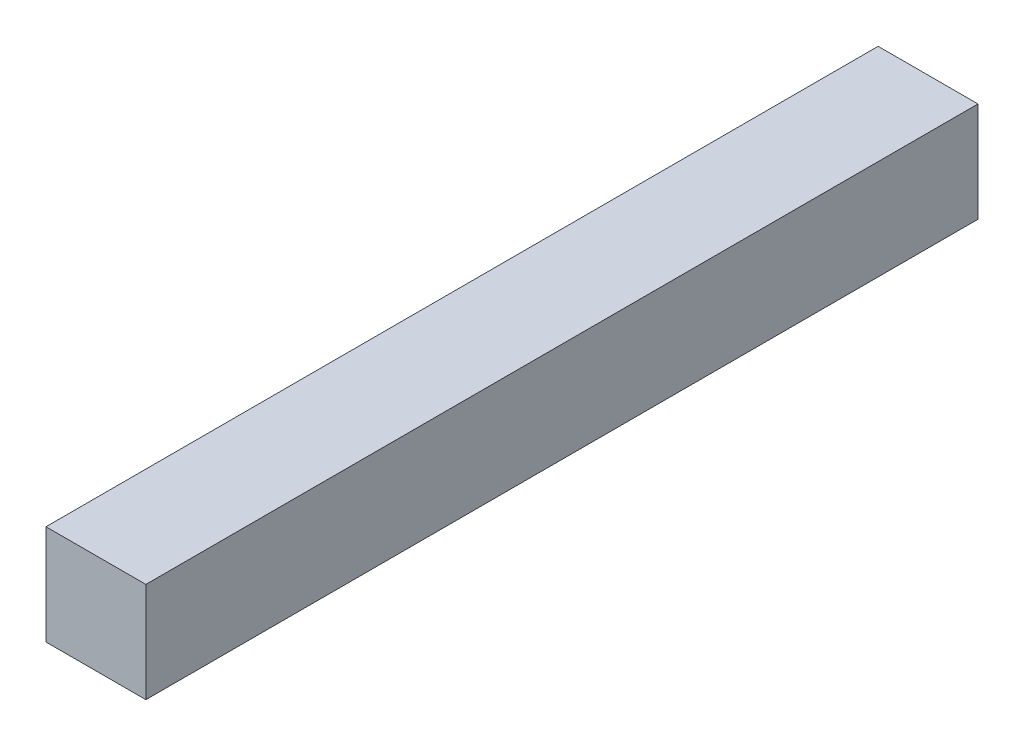
ISO-10303-21;
HEADER;
FILE_DESCRIPTION(('STEP AP214'),'2;1');
FILE_NAME('part.step','',(''),(''),'','','');
FILE_SCHEMA(('AUTOMOTIVE_DESIGN { 1 0 10303 214 1 1 1 1 }'));
ENDSEC;
DATA;
#1=APPLICATION_CONTEXT('core data for automotive mechanical design processes');
#2=APPLICATION_PROTOCOL_DEFINITION('international standard','automotive_design',2000,#1);
#3=PRODUCT_CONTEXT('',#1,'mechanical');
#4=PRODUCT('Part','Part','',(#3));
#5=PRODUCT_RELATED_PRODUCT_CATEGORY('part','',(#4));
#6=PRODUCT_DEFINITION_FORMATION('','',#4);
#7=PRODUCT_DEFINITION_CONTEXT('part definition',#1,'design');
#8=PRODUCT_DEFINITION('design','',#6,#7);
#9=PRODUCT_DEFINITION_SHAPE('','',#8);
#10=(LENGTH_UNIT() NAMED_UNIT(*) SI_UNIT(.MILLI.,.METRE.));
#11=(NAMED_UNIT(*) PLANE_ANGLE_UNIT() SI_UNIT($,.RADIAN.));
#12=(NAMED_UNIT(*) SI_UNIT($,.STERADIAN.) SOLID_ANGLE_UNIT());
#13=UNCERTAINTY_MEASURE_WITH_UNIT(LENGTH_MEASURE(1.E-05),#10,'distance_accuracy_value','');
#14=(GEOMETRIC_REPRESENTATION_CONTEXT(3) GLOBAL_UNCERTAINTY_ASSIGNED_CONTEXT((#13)) GLOBAL_UNIT_ASSIGNED_CONTEXT((#10,
#11,#12)) REPRESENTATION_CONTEXT('',''));
#15=CARTESIAN_POINT('',(0.,0.,0.));
#16=DIRECTION('',(0.,0.,1.));
#17=DIRECTION('',(1.,0.,0.));
#18=AXIS2_PLACEMENT_3D('',#15,#16,#17);
#19=CARTESIAN_POINT('',(3.,3.,50.));
#20=DIRECTION('',(-1.,0.,0.));
#21=DIRECTION('',(0.,-1.,0.));
#22=AXIS2_PLACEMENT_3D('',#19,#20,#21);
#23=PLANE('',#22);
#24=DIRECTION('',(0.,1.,0.));
#25=VECTOR('',#24,1.);
#26=CARTESIAN_POINT('',(3.,3.,0.));
#27=LINE('',#26,#25);
#28=CARTESIAN_POINT('',(3.,-3.,0.));
#29=VERTEX_POINT('',#28);
#30=CARTESIAN_POINT('',(3.,3.,0.));
#31=VERTEX_POINT('',#30);
#32=EDGE_CURVE('E107',#29,#31,#27,.T.);
#33=ORIENTED_EDGE('',*,*,#32,.T.);
#34=DIRECTION('',(0.,0.,-1.));
#35=VECTOR('',#34,1.);
#36=CARTESIAN_POINT('',(3.,3.,50.));
#37=LINE('',#36,#35);
#38=CARTESIAN_POINT('',(3.,3.,50.));
#39=VERTEX_POINT('',#38);
#40=EDGE_CURVE('E11',#39,#31,#37,.T.);
#41=ORIENTED_EDGE('',*,*,#40,.F.);
#42=DIRECTION('',(0.,1.,0.));
#43=VECTOR('',#42,1.);
#44=CARTESIAN_POINT('',(3.,3.,50.));
#45=LINE('',#44,#43);
#46=CARTESIAN_POINT('',(3.,-3.,50.));
#47=VERTEX_POINT('',#46);
#48=EDGE_CURVE('E91',#47,#39,#45,.T.);
#49=ORIENTED_EDGE('',*,*,#48,.F.);
#50=DIRECTION('',(0.,0.,-1.));
#51=VECTOR('',#50,1.);
#52=CARTESIAN_POINT('',(3.,-3.,50.));
#53=LINE('',#52,#51);
#54=EDGE_CURVE('E103',#47,#29,#53,.T.);
#55=ORIENTED_EDGE('',*,*,#54,.T.);
#56=EDGE_LOOP('',(#33,#41,#49,#55));
#57=FACE_BOUND('',#56,.T.);
#58=ADVANCED_FACE('F39',(#57),#23,.F.);
#59=CARTESIAN_POINT('',(-3.,3.,50.));
#60=DIRECTION('',(0.,-1.,0.));
#61=DIRECTION('',(0.,0.,-1.));
#62=AXIS2_PLACEMENT_3D('',#59,#60,#61);
#63=PLANE('',#62);
#64=DIRECTION('',(-1.,0.,0.));
#65=VECTOR('',#64,1.);
#66=CARTESIAN_POINT('',(-3.,3.,0.));
#67=LINE('',#66,#65);
#68=CARTESIAN_POINT('',(-3.,3.,0.));
#69=VERTEX_POINT('',#68);
#70=EDGE_CURVE('E96',#31,#69,#67,.T.);
#71=ORIENTED_EDGE('',*,*,#70,.T.);
#72=DIRECTION('',(0.,0.,-1.));
#73=VECTOR('',#72,1.);
#74=CARTESIAN_POINT('',(-3.,3.,50.));
#75=LINE('',#74,#73);
#76=CARTESIAN_POINT('',(-3.,3.,50.));
#77=VERTEX_POINT('',#76);
#78=EDGE_CURVE('E48',#77,#69,#75,.T.);
#79=ORIENTED_EDGE('',*,*,#78,.F.);
#80=DIRECTION('',(-1.,0.,0.));
#81=VECTOR('',#80,1.);
#82=CARTESIAN_POINT('',(-3.,3.,50.));
#83=LINE('',#82,#81);
#84=EDGE_CURVE('E86',#39,#77,#83,.T.);
#85=ORIENTED_EDGE('',*,*,#84,.F.);
#86=ORIENTED_EDGE('',*,*,#40,.T.);
#87=EDGE_LOOP('',(#71,#79,#85,#86));
#88=FACE_BOUND('',#87,.T.);
#89=ADVANCED_FACE('F95',(#88),#63,.F.);
#90=CARTESIAN_POINT('',(-3.,3.,50.));
#91=DIRECTION('',(1.,0.,0.));
#92=DIRECTION('',(0.,1.,0.));
#93=AXIS2_PLACEMENT_3D('',#90,#91,#92);
#94=PLANE('',#93);
#95=DIRECTION('',(0.,-1.,0.));
#96=VECTOR('',#95,1.);
#97=CARTESIAN_POINT('',(-3.,3.,0.));
#98=LINE('',#97,#96);
#99=CARTESIAN_POINT('',(-3.,-3.,0.));
#100=VERTEX_POINT('',#99);
#101=EDGE_CURVE('E73',#69,#100,#98,.T.);
#102=ORIENTED_EDGE('',*,*,#101,.T.);
#103=DIRECTION('',(0.,0.,-1.));
#104=VECTOR('',#103,1.);
#105=CARTESIAN_POINT('',(-3.,-3.,50.));
#106=LINE('',#105,#104);
#107=CARTESIAN_POINT('',(-3.,-3.,50.));
#108=VERTEX_POINT('',#107);
#109=EDGE_CURVE('E98',#108,#100,#106,.T.);
#110=ORIENTED_EDGE('',*,*,#109,.F.);
#111=DIRECTION('',(0.,-1.,0.));
#112=VECTOR('',#111,1.);
#113=CARTESIAN_POINT('',(-3.,3.,50.));
#114=LINE('',#113,#112);
#115=EDGE_CURVE('E89',#77,#108,#114,.T.);
#116=ORIENTED_EDGE('',*,*,#115,.F.);
#117=ORIENTED_EDGE('',*,*,#78,.T.);
#118=EDGE_LOOP('',(#102,#110,#116,#117));
#119=FACE_BOUND('',#118,.T.);
#120=ADVANCED_FACE('F99',(#119),#94,.F.);
#121=CARTESIAN_POINT('',(-3.,-3.,50.));
#122=DIRECTION('',(0.,1.,0.));
#123=DIRECTION('',(0.,0.,1.));
#124=AXIS2_PLACEMENT_3D('',#121,#122,#123);
#125=PLANE('',#124);
#126=DIRECTION('',(1.,0.,0.));
#127=VECTOR('',#126,1.);
#128=CARTESIAN_POINT('',(-3.,-3.,0.));
#129=LINE('',#128,#127);
#130=EDGE_CURVE('E79',#100,#29,#129,.T.);
#131=ORIENTED_EDGE('',*,*,#130,.T.);
#132=ORIENTED_EDGE('',*,*,#54,.F.);
#133=DIRECTION('',(1.,0.,0.));
#134=VECTOR('',#133,1.);
#135=CARTESIAN_POINT('',(-3.,-3.,50.));
#136=LINE('',#135,#134);
#137=EDGE_CURVE('E56',#108,#47,#136,.T.);
#138=ORIENTED_EDGE('',*,*,#137,.F.);
#139=ORIENTED_EDGE('',*,*,#109,.T.);
#140=EDGE_LOOP('',(#131,#132,#138,#139));
#141=FACE_BOUND('',#140,.T.);
#142=ADVANCED_FACE('F120',(#141),#125,.F.);
#143=CARTESIAN_POINT('',(0.,0.,50.));
#144=DIRECTION('',(0.,0.,1.));
#145=DIRECTION('',(1.,0.,0.));
#146=AXIS2_PLACEMENT_3D('',#143,#144,#145);
#147=PLANE('',#146);
#148=ORIENTED_EDGE('',*,*,#48,.T.);
#149=ORIENTED_EDGE('',*,*,#84,.T.);
#150=ORIENTED_EDGE('',*,*,#115,.T.);
#151=ORIENTED_EDGE('',*,*,#137,.T.);
#152=EDGE_LOOP('',(#148,#149,#150,#151));
#153=FACE_BOUND('',#152,.T.);
#154=ADVANCED_FACE('F87',(#153),#147,.T.);
#155=CARTESIAN_POINT('',(0.,0.,0.));
#156=DIRECTION('',(0.,0.,1.));
#157=DIRECTION('',(1.,0.,0.));
#158=AXIS2_PLACEMENT_3D('',#155,#156,#157);
#159=PLANE('',#158);
#160=ORIENTED_EDGE('',*,*,#32,.F.);
#161=ORIENTED_EDGE('',*,*,#130,.F.);
#162=ORIENTED_EDGE('',*,*,#101,.F.);
#163=ORIENTED_EDGE('',*,*,#70,.F.);
#164=EDGE_LOOP('',(#160,#161,#162,#163));
#165=FACE_BOUND('',#164,.T.);
#166=ADVANCED_FACE('F123',(#165),#159,.F.);
#167=CLOSED_SHELL('',(#58,#89,#120,#142,#154,#166));
#168=MANIFOLD_SOLID_BREP('B2',#167);
#169=ADVANCED_BREP_SHAPE_REPRESENTATION('',(#18,#168),#14);
#170=SHAPE_DEFINITION_REPRESENTATION(#9,#169);
ENDSEC;
END-ISO-10303-21;
